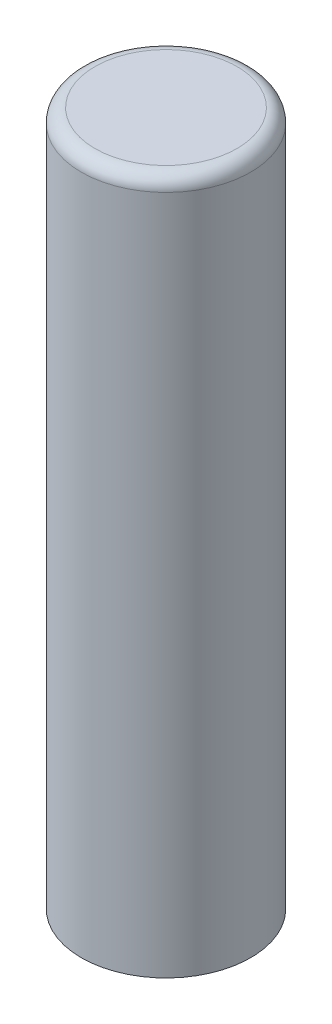
ISO-10303-21;
HEADER;
FILE_DESCRIPTION(('STEP AP214'),'2;1');
FILE_NAME('part.step','',(''),(''),'','','');
FILE_SCHEMA(('AUTOMOTIVE_DESIGN { 1 0 10303 214 1 1 1 1 }'));
ENDSEC;
DATA;
#1=APPLICATION_CONTEXT('core data for automotive mechanical design processes');
#2=APPLICATION_PROTOCOL_DEFINITION('international standard','automotive_design',2000,#1);
#3=PRODUCT_CONTEXT('',#1,'mechanical');
#4=PRODUCT('Part','Part','',(#3));
#5=PRODUCT_RELATED_PRODUCT_CATEGORY('part','',(#4));
#6=PRODUCT_DEFINITION_FORMATION('','',#4);
#7=PRODUCT_DEFINITION_CONTEXT('part definition',#1,'design');
#8=PRODUCT_DEFINITION('design','',#6,#7);
#9=PRODUCT_DEFINITION_SHAPE('','',#8);
#10=(LENGTH_UNIT() NAMED_UNIT(*) SI_UNIT(.MILLI.,.METRE.));
#11=(NAMED_UNIT(*) PLANE_ANGLE_UNIT() SI_UNIT($,.RADIAN.));
#12=(NAMED_UNIT(*) SI_UNIT($,.STERADIAN.) SOLID_ANGLE_UNIT());
#13=UNCERTAINTY_MEASURE_WITH_UNIT(LENGTH_MEASURE(1.E-05),#10,'distance_accuracy_value','');
#14=(GEOMETRIC_REPRESENTATION_CONTEXT(3) GLOBAL_UNCERTAINTY_ASSIGNED_CONTEXT((#13)) GLOBAL_UNIT_ASSIGNED_CONTEXT((#10,
#11,#12)) REPRESENTATION_CONTEXT('',''));
#15=CARTESIAN_POINT('',(0.,0.,0.));
#16=DIRECTION('',(0.,0.,1.));
#17=DIRECTION('',(1.,0.,0.));
#18=AXIS2_PLACEMENT_3D('',#15,#16,#17);
#19=CARTESIAN_POINT('',(0.,12.7,0.));
#20=DIRECTION('',(0.,-1.,0.));
#21=DIRECTION('',(0.,0.,-1.));
#22=AXIS2_PLACEMENT_3D('',#19,#20,#21);
#23=CYLINDRICAL_SURFACE('',#22,1.55);
#24=CARTESIAN_POINT('',(0.,12.45,0.));
#25=DIRECTION('',(0.,1.,0.));
#26=DIRECTION('',(0.,0.,1.));
#27=AXIS2_PLACEMENT_3D('',#24,#25,#26);
#28=CIRCLE('',#27,1.55);
#29=CARTESIAN_POINT('',(0.,12.45,1.55));
#30=VERTEX_POINT('',#29);
#31=EDGE_CURVE('E10',#30,#30,#28,.F.);
#32=ORIENTED_EDGE('',*,*,#31,.T.);
#33=EDGE_LOOP('',(#32));
#34=FACE_BOUND('',#33,.T.);
#35=CARTESIAN_POINT('',(0.,0.,0.));
#36=DIRECTION('',(0.,1.,0.));
#37=DIRECTION('',(0.,0.,1.));
#38=AXIS2_PLACEMENT_3D('',#35,#36,#37);
#39=CIRCLE('',#38,1.55);
#40=CARTESIAN_POINT('',(0.,0.,1.55));
#41=VERTEX_POINT('',#40);
#42=EDGE_CURVE('E42',#41,#41,#39,.T.);
#43=ORIENTED_EDGE('',*,*,#42,.T.);
#44=EDGE_LOOP('',(#43));
#45=FACE_BOUND('',#44,.T.);
#46=ADVANCED_FACE('F31',(#34,#45),#23,.T.);
#47=CARTESIAN_POINT('',(0.,12.7,0.));
#48=DIRECTION('',(0.,1.,0.));
#49=DIRECTION('',(0.,0.,1.));
#50=AXIS2_PLACEMENT_3D('',#47,#48,#49);
#51=PLANE('',#50);
#52=CARTESIAN_POINT('',(0.,12.7,0.));
#53=DIRECTION('',(0.,1.,0.));
#54=DIRECTION('',(0.,0.,1.));
#55=AXIS2_PLACEMENT_3D('',#52,#53,#54);
#56=CIRCLE('',#55,1.3);
#57=CARTESIAN_POINT('',(0.,12.7,1.3));
#58=VERTEX_POINT('',#57);
#59=EDGE_CURVE('E38',#58,#58,#56,.T.);
#60=ORIENTED_EDGE('',*,*,#59,.T.);
#61=EDGE_LOOP('',(#60));
#62=FACE_BOUND('',#61,.T.);
#63=ADVANCED_FACE('F52',(#62),#51,.T.);
#64=CARTESIAN_POINT('',(0.,0.,0.));
#65=DIRECTION('',(0.,1.,0.));
#66=DIRECTION('',(0.,0.,1.));
#67=AXIS2_PLACEMENT_3D('',#64,#65,#66);
#68=PLANE('',#67);
#69=ORIENTED_EDGE('',*,*,#42,.F.);
#70=EDGE_LOOP('',(#69));
#71=FACE_BOUND('',#70,.T.);
#72=ADVANCED_FACE('F50',(#71),#68,.F.);
#73=CARTESIAN_POINT('',(0.,12.45,0.));
#74=DIRECTION('',(0.,1.,0.));
#75=DIRECTION('',(0.,0.,1.));
#76=AXIS2_PLACEMENT_3D('',#73,#74,#75);
#77=TOROIDAL_SURFACE('',#76,1.3,0.25);
#78=ORIENTED_EDGE('',*,*,#31,.F.);
#79=EDGE_LOOP('',(#78));
#80=FACE_BOUND('',#79,.T.);
#81=ORIENTED_EDGE('',*,*,#59,.F.);
#82=EDGE_LOOP('',(#81));
#83=FACE_BOUND('',#82,.T.);
#84=ADVANCED_FACE('F33',(#80,#83),#77,.T.);
#85=CLOSED_SHELL('',(#46,#63,#72,#84));
#86=MANIFOLD_SOLID_BREP('B2',#85);
#87=ADVANCED_BREP_SHAPE_REPRESENTATION('',(#18,#86),#14);
#88=SHAPE_DEFINITION_REPRESENTATION(#9,#87);
ENDSEC;
END-ISO-10303-21;
